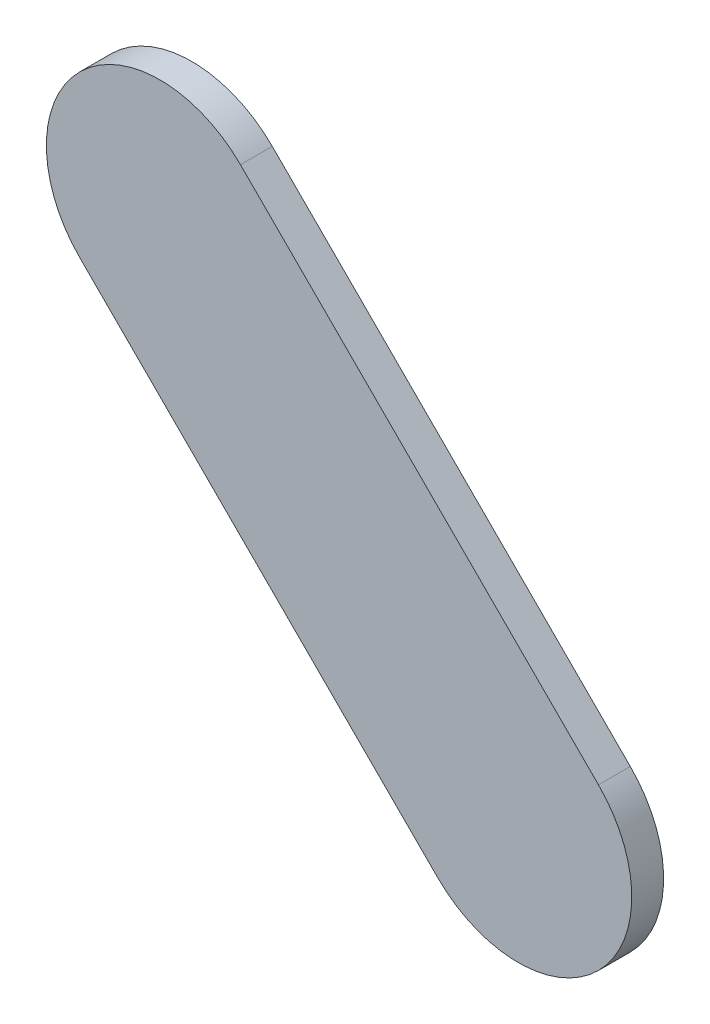
ISO-10303-21;
HEADER;
FILE_DESCRIPTION(('STEP AP214'),'2;1');
FILE_NAME('part.step','',(''),(''),'','','');
FILE_SCHEMA(('AUTOMOTIVE_DESIGN { 1 0 10303 214 1 1 1 1 }'));
ENDSEC;
DATA;
#1=APPLICATION_CONTEXT('core data for automotive mechanical design processes');
#2=APPLICATION_PROTOCOL_DEFINITION('international standard','automotive_design',2000,#1);
#3=PRODUCT_CONTEXT('',#1,'mechanical');
#4=PRODUCT('Part','Part','',(#3));
#5=PRODUCT_RELATED_PRODUCT_CATEGORY('part','',(#4));
#6=PRODUCT_DEFINITION_FORMATION('','',#4);
#7=PRODUCT_DEFINITION_CONTEXT('part definition',#1,'design');
#8=PRODUCT_DEFINITION('design','',#6,#7);
#9=PRODUCT_DEFINITION_SHAPE('','',#8);
#10=(LENGTH_UNIT() NAMED_UNIT(*) SI_UNIT(.MILLI.,.METRE.));
#11=(NAMED_UNIT(*) PLANE_ANGLE_UNIT() SI_UNIT($,.RADIAN.));
#12=(NAMED_UNIT(*) SI_UNIT($,.STERADIAN.) SOLID_ANGLE_UNIT());
#13=UNCERTAINTY_MEASURE_WITH_UNIT(LENGTH_MEASURE(1.E-05),#10,'distance_accuracy_value','');
#14=(GEOMETRIC_REPRESENTATION_CONTEXT(3) GLOBAL_UNCERTAINTY_ASSIGNED_CONTEXT((#13)) GLOBAL_UNIT_ASSIGNED_CONTEXT((#10,
#11,#12)) REPRESENTATION_CONTEXT('',''));
#15=CARTESIAN_POINT('',(0.,0.,0.));
#16=DIRECTION('',(0.,0.,1.));
#17=DIRECTION('',(1.,0.,0.));
#18=AXIS2_PLACEMENT_3D('',#15,#16,#17);
#19=CARTESIAN_POINT('',(93.32717174,91.69716992,0.));
#20=DIRECTION('',(0.707106781186548,0.707106781186548,0.));
#21=DIRECTION('',(0.707106781186548,-0.707106781186548,0.));
#22=AXIS2_PLACEMENT_3D('',#19,#20,#21);
#23=PLANE('',#22);
#24=DIRECTION('',(0.707106781186548,-0.707106781186548,0.));
#25=VECTOR('',#24,1.);
#26=CARTESIAN_POINT('',(93.32717174,91.69716992,0.03556));
#27=LINE('',#26,#25);
#28=CARTESIAN_POINT('',(93.32717174,91.69716992,0.03556));
#29=VERTEX_POINT('',#28);
#30=CARTESIAN_POINT('',(93.72717094,91.29717072,0.03556));
#31=VERTEX_POINT('',#30);
#32=EDGE_CURVE('E11',#29,#31,#27,.T.);
#33=ORIENTED_EDGE('',*,*,#32,.F.);
#34=DIRECTION('',(0.,0.,1.));
#35=VECTOR('',#34,1.);
#36=CARTESIAN_POINT('',(93.32717174,91.69716992,0.));
#37=LINE('',#36,#35);
#38=CARTESIAN_POINT('',(93.32717174,91.69716992,0.));
#39=VERTEX_POINT('',#38);
#40=EDGE_CURVE('E24',#39,#29,#37,.T.);
#41=ORIENTED_EDGE('',*,*,#40,.F.);
#42=DIRECTION('',(0.707106781186548,-0.707106781186548,0.));
#43=VECTOR('',#42,1.);
#44=CARTESIAN_POINT('',(93.32717174,91.69716992,0.));
#45=LINE('',#44,#43);
#46=CARTESIAN_POINT('',(93.72717094,91.29717072,0.));
#47=VERTEX_POINT('',#46);
#48=EDGE_CURVE('E75',#39,#47,#45,.T.);
#49=ORIENTED_EDGE('',*,*,#48,.T.);
#50=DIRECTION('',(0.,0.,1.));
#51=VECTOR('',#50,1.);
#52=CARTESIAN_POINT('',(93.72717094,91.29717072,0.));
#53=LINE('',#52,#51);
#54=EDGE_CURVE('E37',#47,#31,#53,.T.);
#55=ORIENTED_EDGE('',*,*,#54,.T.);
#56=EDGE_LOOP('',(#33,#41,#49,#55));
#57=FACE_BOUND('',#56,.T.);
#58=ADVANCED_FACE('F17',(#57),#23,.F.);
#59=CARTESIAN_POINT('',(93.81697264,91.38697242,0.));
#60=DIRECTION('',(0.,0.,-1.));
#61=DIRECTION('',(-0.707106781186548,-0.707106781186548,0.));
#62=AXIS2_PLACEMENT_3D('',#59,#60,#61);
#63=CYLINDRICAL_SURFACE('',#62,0.12699878206416);
#64=CARTESIAN_POINT('',(93.81697264,91.38697242,0.03556));
#65=DIRECTION('',(0.,0.,1.));
#66=DIRECTION('',(-0.707106781186548,-0.707106781186548,0.));
#67=AXIS2_PLACEMENT_3D('',#64,#65,#66);
#68=CIRCLE('',#67,0.12699878206416);
#69=CARTESIAN_POINT('',(93.90677434,91.47677412,0.03556));
#70=VERTEX_POINT('',#69);
#71=EDGE_CURVE('E83',#31,#70,#68,.T.);
#72=ORIENTED_EDGE('',*,*,#71,.F.);
#73=ORIENTED_EDGE('',*,*,#54,.F.);
#74=CARTESIAN_POINT('',(93.81697264,91.38697242,0.));
#75=DIRECTION('',(0.,0.,1.));
#76=DIRECTION('',(-0.707106781186548,-0.707106781186548,0.));
#77=AXIS2_PLACEMENT_3D('',#74,#75,#76);
#78=CIRCLE('',#77,0.12699878206416);
#79=CARTESIAN_POINT('',(93.90677434,91.47677412,0.));
#80=VERTEX_POINT('',#79);
#81=EDGE_CURVE('E81',#47,#80,#78,.T.);
#82=ORIENTED_EDGE('',*,*,#81,.T.);
#83=DIRECTION('',(0.,0.,1.));
#84=VECTOR('',#83,1.);
#85=CARTESIAN_POINT('',(93.90677434,91.47677412,0.));
#86=LINE('',#85,#84);
#87=EDGE_CURVE('E67',#80,#70,#86,.T.);
#88=ORIENTED_EDGE('',*,*,#87,.T.);
#89=EDGE_LOOP('',(#72,#73,#82,#88));
#90=FACE_BOUND('',#89,.T.);
#91=ADVANCED_FACE('F89',(#90),#63,.T.);
#92=CARTESIAN_POINT('',(93.90677434,91.47677412,0.));
#93=DIRECTION('',(-0.70710678118656,-0.707106781186535,0.));
#94=DIRECTION('',(-0.707106781186535,0.70710678118656,0.));
#95=AXIS2_PLACEMENT_3D('',#92,#93,#94);
#96=PLANE('',#95);
#97=DIRECTION('',(-0.707106781186535,0.70710678118656,0.));
#98=VECTOR('',#97,1.);
#99=CARTESIAN_POINT('',(93.90677434,91.47677412,0.03556));
#100=LINE('',#99,#98);
#101=CARTESIAN_POINT('',(93.50677514,91.87677332,0.03556));
#102=VERTEX_POINT('',#101);
#103=EDGE_CURVE('E71',#70,#102,#100,.T.);
#104=ORIENTED_EDGE('',*,*,#103,.F.);
#105=ORIENTED_EDGE('',*,*,#87,.F.);
#106=DIRECTION('',(-0.707106781186535,0.70710678118656,0.));
#107=VECTOR('',#106,1.);
#108=CARTESIAN_POINT('',(93.90677434,91.47677412,0.));
#109=LINE('',#108,#107);
#110=CARTESIAN_POINT('',(93.50677514,91.87677332,0.));
#111=VERTEX_POINT('',#110);
#112=EDGE_CURVE('E63',#80,#111,#109,.T.);
#113=ORIENTED_EDGE('',*,*,#112,.T.);
#114=DIRECTION('',(0.,0.,1.));
#115=VECTOR('',#114,1.);
#116=CARTESIAN_POINT('',(93.50677514,91.87677332,0.));
#117=LINE('',#116,#115);
#118=EDGE_CURVE('E53',#111,#102,#117,.T.);
#119=ORIENTED_EDGE('',*,*,#118,.T.);
#120=EDGE_LOOP('',(#104,#105,#113,#119));
#121=FACE_BOUND('',#120,.T.);
#122=ADVANCED_FACE('F66',(#121),#96,.F.);
#123=CARTESIAN_POINT('',(93.41697344,91.78697162,0.));
#124=DIRECTION('',(0.,0.,-1.));
#125=DIRECTION('',(0.707106781186604,0.707106781186492,0.));
#126=AXIS2_PLACEMENT_3D('',#123,#124,#125);
#127=CYLINDRICAL_SURFACE('',#126,0.12699878206416);
#128=CARTESIAN_POINT('',(93.41697344,91.78697162,0.03556));
#129=DIRECTION('',(0.,0.,1.));
#130=DIRECTION('',(0.707106781186604,0.707106781186492,0.));
#131=AXIS2_PLACEMENT_3D('',#128,#129,#130);
#132=CIRCLE('',#131,0.12699878206416);
#133=EDGE_CURVE('E59',#102,#29,#132,.T.);
#134=ORIENTED_EDGE('',*,*,#133,.F.);
#135=ORIENTED_EDGE('',*,*,#118,.F.);
#136=CARTESIAN_POINT('',(93.41697344,91.78697162,0.));
#137=DIRECTION('',(0.,0.,1.));
#138=DIRECTION('',(0.707106781186604,0.707106781186492,0.));
#139=AXIS2_PLACEMENT_3D('',#136,#137,#138);
#140=CIRCLE('',#139,0.12699878206416);
#141=EDGE_CURVE('E57',#111,#39,#140,.T.);
#142=ORIENTED_EDGE('',*,*,#141,.T.);
#143=ORIENTED_EDGE('',*,*,#40,.T.);
#144=EDGE_LOOP('',(#134,#135,#142,#143));
#145=FACE_BOUND('',#144,.T.);
#146=ADVANCED_FACE('F55',(#145),#127,.T.);
#147=CARTESIAN_POINT('',(93.32717174,91.69716992,0.));
#148=DIRECTION('',(0.,0.,-1.));
#149=DIRECTION('',(-1.,0.,0.));
#150=AXIS2_PLACEMENT_3D('',#147,#148,#149);
#151=PLANE('',#150);
#152=ORIENTED_EDGE('',*,*,#141,.F.);
#153=ORIENTED_EDGE('',*,*,#112,.F.);
#154=ORIENTED_EDGE('',*,*,#81,.F.);
#155=ORIENTED_EDGE('',*,*,#48,.F.);
#156=EDGE_LOOP('',(#152,#153,#154,#155));
#157=FACE_BOUND('',#156,.T.);
#158=ADVANCED_FACE('F74',(#157),#151,.T.);
#159=CARTESIAN_POINT('',(93.32717174,91.69716992,0.03556));
#160=DIRECTION('',(0.,0.,-1.));
#161=DIRECTION('',(-1.,0.,0.));
#162=AXIS2_PLACEMENT_3D('',#159,#160,#161);
#163=PLANE('',#162);
#164=ORIENTED_EDGE('',*,*,#32,.T.);
#165=ORIENTED_EDGE('',*,*,#71,.T.);
#166=ORIENTED_EDGE('',*,*,#103,.T.);
#167=ORIENTED_EDGE('',*,*,#133,.T.);
#168=EDGE_LOOP('',(#164,#165,#166,#167));
#169=FACE_BOUND('',#168,.T.);
#170=ADVANCED_FACE('F91',(#169),#163,.F.);
#171=CLOSED_SHELL('',(#58,#91,#122,#146,#158,#170));
#172=MANIFOLD_SOLID_BREP('B1',#171);
#173=ADVANCED_BREP_SHAPE_REPRESENTATION('',(#18,#172),#14);
#174=SHAPE_DEFINITION_REPRESENTATION(#9,#173);
ENDSEC;
END-ISO-10303-21;
